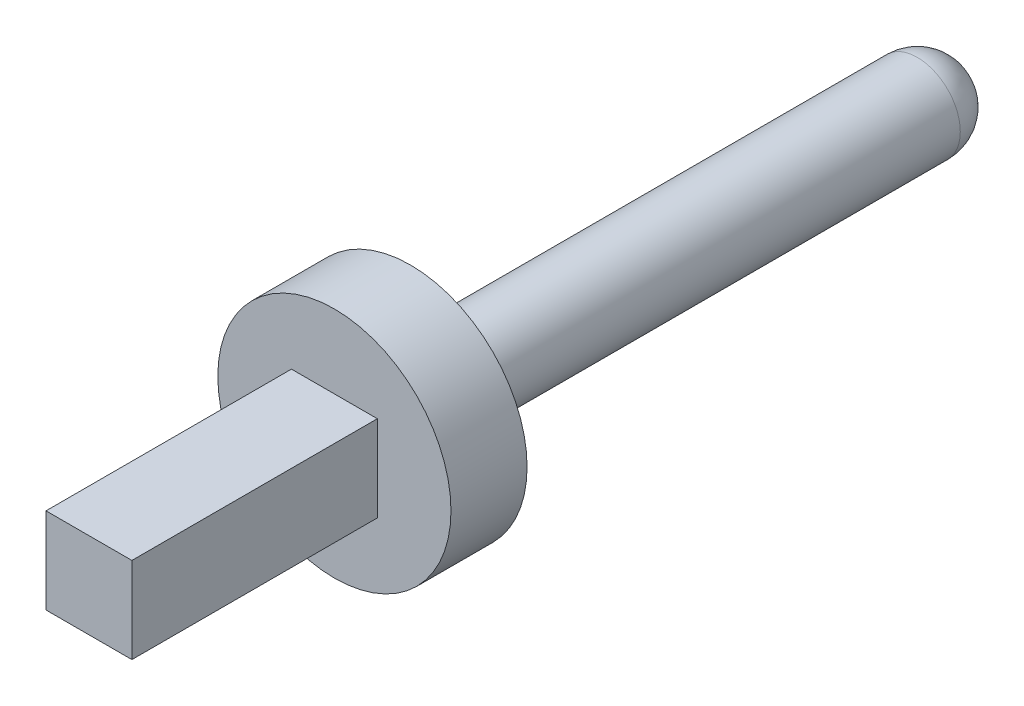
ISO-10303-21;
HEADER;
FILE_DESCRIPTION(('STEP AP214'),'2;1');
FILE_NAME('part.step','',(''),(''),'','','');
FILE_SCHEMA(('AUTOMOTIVE_DESIGN { 1 0 10303 214 1 1 1 1 }'));
ENDSEC;
DATA;
#1=APPLICATION_CONTEXT('core data for automotive mechanical design processes');
#2=APPLICATION_PROTOCOL_DEFINITION('international standard','automotive_design',2000,#1);
#3=PRODUCT_CONTEXT('',#1,'mechanical');
#4=PRODUCT('Part','Part','',(#3));
#5=PRODUCT_RELATED_PRODUCT_CATEGORY('part','',(#4));
#6=PRODUCT_DEFINITION_FORMATION('','',#4);
#7=PRODUCT_DEFINITION_CONTEXT('part definition',#1,'design');
#8=PRODUCT_DEFINITION('design','',#6,#7);
#9=PRODUCT_DEFINITION_SHAPE('','',#8);
#10=(LENGTH_UNIT() NAMED_UNIT(*) SI_UNIT(.MILLI.,.METRE.));
#11=(NAMED_UNIT(*) PLANE_ANGLE_UNIT() SI_UNIT($,.RADIAN.));
#12=(NAMED_UNIT(*) SI_UNIT($,.STERADIAN.) SOLID_ANGLE_UNIT());
#13=UNCERTAINTY_MEASURE_WITH_UNIT(LENGTH_MEASURE(1.E-05),#10,'distance_accuracy_value','');
#14=(GEOMETRIC_REPRESENTATION_CONTEXT(3) GLOBAL_UNCERTAINTY_ASSIGNED_CONTEXT((#13)) GLOBAL_UNIT_ASSIGNED_CONTEXT((#10,
#11,#12)) REPRESENTATION_CONTEXT('',''));
#15=CARTESIAN_POINT('',(0.,0.,0.));
#16=DIRECTION('',(0.,0.,1.));
#17=DIRECTION('',(1.,0.,0.));
#18=AXIS2_PLACEMENT_3D('',#15,#16,#17);
#19=CARTESIAN_POINT('',(-5.,-2.25,-0.62));
#20=DIRECTION('',(0.,0.,-1.));
#21=DIRECTION('',(1.,0.,0.));
#22=AXIS2_PLACEMENT_3D('',#19,#20,#21);
#23=CYLINDRICAL_SURFACE('',#22,0.95);
#24=CARTESIAN_POINT('',(-5.,-2.25,-0.62));
#25=DIRECTION('',(0.,0.,1.));
#26=DIRECTION('',(0.,1.,0.));
#27=AXIS2_PLACEMENT_3D('',#24,#25,#26);
#28=CIRCLE('',#27,0.95);
#29=CARTESIAN_POINT('',(-5.,-1.3,-0.62));
#30=VERTEX_POINT('',#29);
#31=EDGE_CURVE('E27',#30,#30,#28,.T.);
#32=ORIENTED_EDGE('',*,*,#31,.T.);
#33=EDGE_LOOP('',(#32));
#34=FACE_BOUND('',#33,.T.);
#35=CARTESIAN_POINT('',(-5.,-2.25,0.));
#36=DIRECTION('',(0.,0.,1.));
#37=DIRECTION('',(0.,1.,0.));
#38=AXIS2_PLACEMENT_3D('',#35,#36,#37);
#39=CIRCLE('',#38,0.95);
#40=CARTESIAN_POINT('',(-5.,-1.3,0.));
#41=VERTEX_POINT('',#40);
#42=EDGE_CURVE('E131',#41,#41,#39,.T.);
#43=ORIENTED_EDGE('',*,*,#42,.F.);
#44=EDGE_LOOP('',(#43));
#45=FACE_BOUND('',#44,.T.);
#46=ADVANCED_FACE('F16',(#34,#45),#23,.T.);
#47=CARTESIAN_POINT('',(-5.,-2.25,-5.1));
#48=DIRECTION('',(0.,0.,-1.));
#49=DIRECTION('',(1.,0.,0.));
#50=AXIS2_PLACEMENT_3D('',#47,#48,#49);
#51=CYLINDRICAL_SURFACE('',#50,0.35);
#52=CARTESIAN_POINT('',(-5.,-2.25,-4.75));
#53=DIRECTION('',(0.,0.,1.));
#54=DIRECTION('',(1.,0.,0.));
#55=AXIS2_PLACEMENT_3D('',#52,#53,#54);
#56=CIRCLE('',#55,0.35);
#57=CARTESIAN_POINT('',(-4.65,-2.25,-4.75));
#58=VERTEX_POINT('',#57);
#59=EDGE_CURVE('E112',#58,#58,#56,.T.);
#60=ORIENTED_EDGE('',*,*,#59,.T.);
#61=EDGE_LOOP('',(#60));
#62=FACE_BOUND('',#61,.T.);
#63=CARTESIAN_POINT('',(-5.,-2.25,-0.62));
#64=DIRECTION('',(0.,0.,1.));
#65=DIRECTION('',(0.,1.,0.));
#66=AXIS2_PLACEMENT_3D('',#63,#64,#65);
#67=CIRCLE('',#66,0.35);
#68=CARTESIAN_POINT('',(-5.,-1.9,-0.62));
#69=VERTEX_POINT('',#68);
#70=EDGE_CURVE('E10',#69,#69,#67,.T.);
#71=ORIENTED_EDGE('',*,*,#70,.F.);
#72=EDGE_LOOP('',(#71));
#73=FACE_BOUND('',#72,.T.);
#74=ADVANCED_FACE('F173',(#62,#73),#51,.T.);
#75=CARTESIAN_POINT('',(-5.,-2.25,-0.62));
#76=DIRECTION('',(0.,0.,1.));
#77=DIRECTION('',(1.,0.,0.));
#78=AXIS2_PLACEMENT_3D('',#75,#76,#77);
#79=PLANE('',#78);
#80=ORIENTED_EDGE('',*,*,#70,.T.);
#81=EDGE_LOOP('',(#80));
#82=FACE_BOUND('',#81,.T.);
#83=ORIENTED_EDGE('',*,*,#31,.F.);
#84=EDGE_LOOP('',(#83));
#85=FACE_BOUND('',#84,.T.);
#86=ADVANCED_FACE('F180',(#82,#85),#79,.F.);
#87=CARTESIAN_POINT('',(-5.,-2.25,0.));
#88=DIRECTION('',(0.,0.,1.));
#89=DIRECTION('',(1.,0.,0.));
#90=AXIS2_PLACEMENT_3D('',#87,#88,#89);
#91=PLANE('',#90);
#92=DIRECTION('',(1.,0.,0.));
#93=VECTOR('',#92,1.);
#94=CARTESIAN_POINT('',(-5.35,-2.6,0.));
#95=LINE('',#94,#93);
#96=CARTESIAN_POINT('',(-5.35,-2.6,0.));
#97=VERTEX_POINT('',#96);
#98=CARTESIAN_POINT('',(-4.65,-2.6,0.));
#99=VERTEX_POINT('',#98);
#100=EDGE_CURVE('E58',#97,#99,#95,.T.);
#101=ORIENTED_EDGE('',*,*,#100,.F.);
#102=DIRECTION('',(0.,-1.,0.));
#103=VECTOR('',#102,1.);
#104=CARTESIAN_POINT('',(-5.35,-1.9,0.));
#105=LINE('',#104,#103);
#106=CARTESIAN_POINT('',(-5.35,-1.9,0.));
#107=VERTEX_POINT('',#106);
#108=EDGE_CURVE('E127',#107,#97,#105,.T.);
#109=ORIENTED_EDGE('',*,*,#108,.F.);
#110=DIRECTION('',(-1.,0.,0.));
#111=VECTOR('',#110,1.);
#112=CARTESIAN_POINT('',(-4.65,-1.9,0.));
#113=LINE('',#112,#111);
#114=CARTESIAN_POINT('',(-4.65,-1.9,0.));
#115=VERTEX_POINT('',#114);
#116=EDGE_CURVE('E71',#115,#107,#113,.T.);
#117=ORIENTED_EDGE('',*,*,#116,.F.);
#118=DIRECTION('',(0.,1.,0.));
#119=VECTOR('',#118,1.);
#120=CARTESIAN_POINT('',(-4.65,-2.6,0.));
#121=LINE('',#120,#119);
#122=EDGE_CURVE('E105',#99,#115,#121,.T.);
#123=ORIENTED_EDGE('',*,*,#122,.F.);
#124=EDGE_LOOP('',(#101,#109,#117,#123));
#125=FACE_BOUND('',#124,.T.);
#126=ORIENTED_EDGE('',*,*,#42,.T.);
#127=EDGE_LOOP('',(#126));
#128=FACE_BOUND('',#127,.T.);
#129=ADVANCED_FACE('F165',(#125,#128),#91,.T.);
#130=CARTESIAN_POINT('',(-5.35,-2.6,0.));
#131=DIRECTION('',(0.,-1.,0.));
#132=DIRECTION('',(0.,0.,-1.));
#133=AXIS2_PLACEMENT_3D('',#130,#131,#132);
#134=PLANE('',#133);
#135=DIRECTION('',(1.,0.,0.));
#136=VECTOR('',#135,1.);
#137=CARTESIAN_POINT('',(-5.35,-2.6,2.));
#138=LINE('',#137,#136);
#139=CARTESIAN_POINT('',(-5.35,-2.6,2.));
#140=VERTEX_POINT('',#139);
#141=CARTESIAN_POINT('',(-4.65,-2.6,2.));
#142=VERTEX_POINT('',#141);
#143=EDGE_CURVE('E108',#140,#142,#138,.T.);
#144=ORIENTED_EDGE('',*,*,#143,.F.);
#145=DIRECTION('',(0.,0.,1.));
#146=VECTOR('',#145,1.);
#147=CARTESIAN_POINT('',(-5.35,-2.6,0.));
#148=LINE('',#147,#146);
#149=EDGE_CURVE('E119',#97,#140,#148,.T.);
#150=ORIENTED_EDGE('',*,*,#149,.F.);
#151=ORIENTED_EDGE('',*,*,#100,.T.);
#152=DIRECTION('',(0.,0.,1.));
#153=VECTOR('',#152,1.);
#154=CARTESIAN_POINT('',(-4.65,-2.6,0.));
#155=LINE('',#154,#153);
#156=EDGE_CURVE('E111',#99,#142,#155,.T.);
#157=ORIENTED_EDGE('',*,*,#156,.T.);
#158=EDGE_LOOP('',(#144,#150,#151,#157));
#159=FACE_BOUND('',#158,.T.);
#160=ADVANCED_FACE('F184',(#159),#134,.T.);
#161=CARTESIAN_POINT('',(-5.35,-2.6,2.));
#162=DIRECTION('',(0.,0.,1.));
#163=DIRECTION('',(1.,0.,0.));
#164=AXIS2_PLACEMENT_3D('',#161,#162,#163);
#165=PLANE('',#164);
#166=DIRECTION('',(0.,-1.,0.));
#167=VECTOR('',#166,1.);
#168=CARTESIAN_POINT('',(-5.35,-1.9,2.));
#169=LINE('',#168,#167);
#170=CARTESIAN_POINT('',(-5.35,-1.9,2.));
#171=VERTEX_POINT('',#170);
#172=EDGE_CURVE('E143',#171,#140,#169,.T.);
#173=ORIENTED_EDGE('',*,*,#172,.T.);
#174=ORIENTED_EDGE('',*,*,#143,.T.);
#175=DIRECTION('',(0.,1.,0.));
#176=VECTOR('',#175,1.);
#177=CARTESIAN_POINT('',(-4.65,-2.6,2.));
#178=LINE('',#177,#176);
#179=CARTESIAN_POINT('',(-4.65,-1.9,2.));
#180=VERTEX_POINT('',#179);
#181=EDGE_CURVE('E20',#142,#180,#178,.T.);
#182=ORIENTED_EDGE('',*,*,#181,.T.);
#183=DIRECTION('',(-1.,0.,0.));
#184=VECTOR('',#183,1.);
#185=CARTESIAN_POINT('',(-4.65,-1.9,2.));
#186=LINE('',#185,#184);
#187=EDGE_CURVE('E88',#180,#171,#186,.T.);
#188=ORIENTED_EDGE('',*,*,#187,.T.);
#189=EDGE_LOOP('',(#173,#174,#182,#188));
#190=FACE_BOUND('',#189,.T.);
#191=ADVANCED_FACE('F18',(#190),#165,.T.);
#192=CARTESIAN_POINT('',(-4.65,-1.9,0.));
#193=DIRECTION('',(0.,1.,0.));
#194=DIRECTION('',(1.,0.,0.));
#195=AXIS2_PLACEMENT_3D('',#192,#193,#194);
#196=PLANE('',#195);
#197=ORIENTED_EDGE('',*,*,#187,.F.);
#198=DIRECTION('',(0.,0.,1.));
#199=VECTOR('',#198,1.);
#200=CARTESIAN_POINT('',(-4.65,-1.9,0.));
#201=LINE('',#200,#199);
#202=EDGE_CURVE('E91',#115,#180,#201,.T.);
#203=ORIENTED_EDGE('',*,*,#202,.F.);
#204=ORIENTED_EDGE('',*,*,#116,.T.);
#205=DIRECTION('',(0.,0.,1.));
#206=VECTOR('',#205,1.);
#207=CARTESIAN_POINT('',(-5.35,-1.9,0.));
#208=LINE('',#207,#206);
#209=EDGE_CURVE('E94',#107,#171,#208,.T.);
#210=ORIENTED_EDGE('',*,*,#209,.T.);
#211=EDGE_LOOP('',(#197,#203,#204,#210));
#212=FACE_BOUND('',#211,.T.);
#213=ADVANCED_FACE('F90',(#212),#196,.T.);
#214=CARTESIAN_POINT('',(-4.65,-2.6,0.));
#215=DIRECTION('',(1.,0.,0.));
#216=DIRECTION('',(0.,1.,0.));
#217=AXIS2_PLACEMENT_3D('',#214,#215,#216);
#218=PLANE('',#217);
#219=ORIENTED_EDGE('',*,*,#181,.F.);
#220=ORIENTED_EDGE('',*,*,#156,.F.);
#221=ORIENTED_EDGE('',*,*,#122,.T.);
#222=ORIENTED_EDGE('',*,*,#202,.T.);
#223=EDGE_LOOP('',(#219,#220,#221,#222));
#224=FACE_BOUND('',#223,.T.);
#225=ADVANCED_FACE('F103',(#224),#218,.T.);
#226=CARTESIAN_POINT('',(-5.,-2.25,-4.75));
#227=DIRECTION('',(0.,0.,1.));
#228=DIRECTION('',(1.,0.,0.));
#229=AXIS2_PLACEMENT_3D('',#226,#227,#228);
#230=SPHERICAL_SURFACE('',#229,0.35);
#231=ORIENTED_EDGE('',*,*,#59,.F.);
#232=EDGE_LOOP('',(#231));
#233=FACE_BOUND('',#232,.T.);
#234=ADVANCED_FACE('F191',(#233),#230,.T.);
#235=CARTESIAN_POINT('',(-5.35,-1.9,0.));
#236=DIRECTION('',(-1.,0.,0.));
#237=DIRECTION('',(0.,0.,1.));
#238=AXIS2_PLACEMENT_3D('',#235,#236,#237);
#239=PLANE('',#238);
#240=ORIENTED_EDGE('',*,*,#172,.F.);
#241=ORIENTED_EDGE('',*,*,#209,.F.);
#242=ORIENTED_EDGE('',*,*,#108,.T.);
#243=ORIENTED_EDGE('',*,*,#149,.T.);
#244=EDGE_LOOP('',(#240,#241,#242,#243));
#245=FACE_BOUND('',#244,.T.);
#246=ADVANCED_FACE('F164',(#245),#239,.T.);
#247=CLOSED_SHELL('',(#46,#74,#86,#129,#160,#191,#213,#225,#234,#246));
#248=MANIFOLD_SOLID_BREP('B1',#247);
#249=ADVANCED_BREP_SHAPE_REPRESENTATION('',(#18,#248),#14);
#250=SHAPE_DEFINITION_REPRESENTATION(#9,#249);
ENDSEC;
END-ISO-10303-21;
